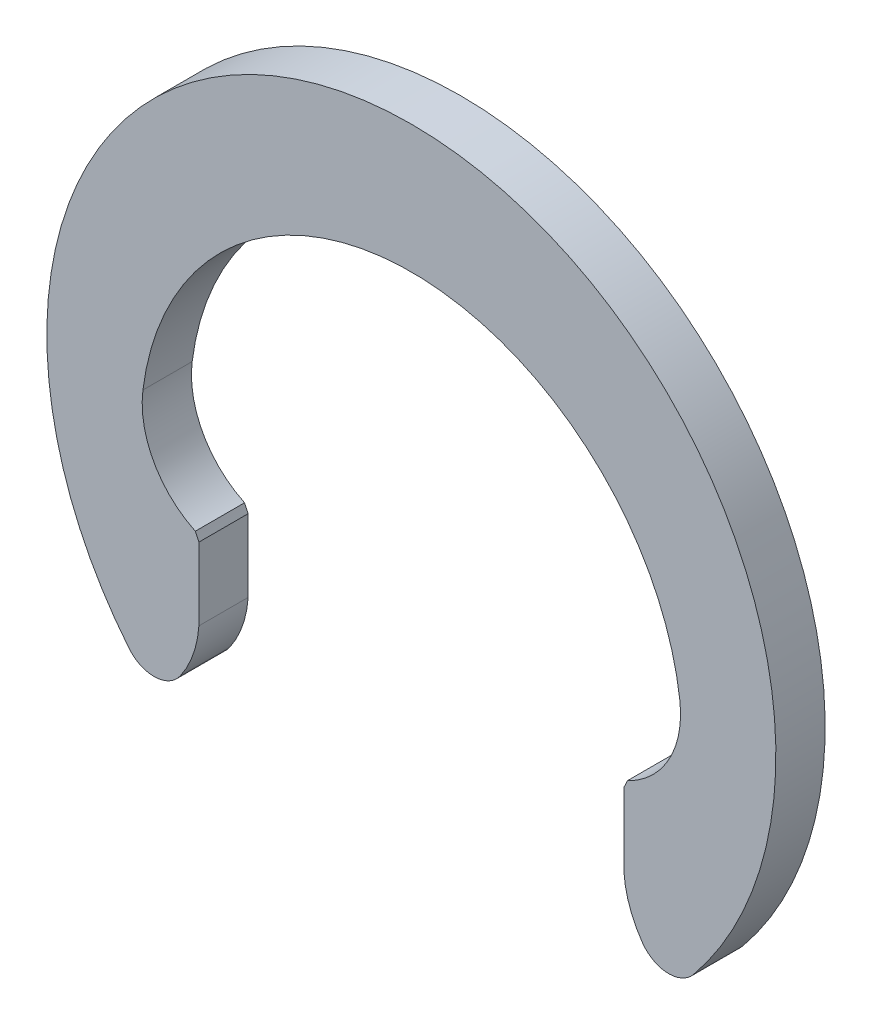
ISO-10303-21;
HEADER;
FILE_DESCRIPTION(('STEP AP214'),'2;1');
FILE_NAME('part.step','',(''),(''),'','','');
FILE_SCHEMA(('AUTOMOTIVE_DESIGN { 1 0 10303 214 1 1 1 1 }'));
ENDSEC;
DATA;
#1=APPLICATION_CONTEXT('core data for automotive mechanical design processes');
#2=APPLICATION_PROTOCOL_DEFINITION('international standard','automotive_design',2000,#1);
#3=PRODUCT_CONTEXT('',#1,'mechanical');
#4=PRODUCT('Part','Part','',(#3));
#5=PRODUCT_RELATED_PRODUCT_CATEGORY('part','',(#4));
#6=PRODUCT_DEFINITION_FORMATION('','',#4);
#7=PRODUCT_DEFINITION_CONTEXT('part definition',#1,'design');
#8=PRODUCT_DEFINITION('design','',#6,#7);
#9=PRODUCT_DEFINITION_SHAPE('','',#8);
#10=(LENGTH_UNIT() NAMED_UNIT(*) SI_UNIT(.MILLI.,.METRE.));
#11=(NAMED_UNIT(*) PLANE_ANGLE_UNIT() SI_UNIT($,.RADIAN.));
#12=(NAMED_UNIT(*) SI_UNIT($,.STERADIAN.) SOLID_ANGLE_UNIT());
#13=UNCERTAINTY_MEASURE_WITH_UNIT(LENGTH_MEASURE(1.E-05),#10,'distance_accuracy_value','');
#14=(GEOMETRIC_REPRESENTATION_CONTEXT(3) GLOBAL_UNCERTAINTY_ASSIGNED_CONTEXT((#13)) GLOBAL_UNIT_ASSIGNED_CONTEXT((#10,
#11,#12)) REPRESENTATION_CONTEXT('',''));
#15=CARTESIAN_POINT('',(0.,0.,0.));
#16=DIRECTION('',(0.,0.,1.));
#17=DIRECTION('',(1.,0.,0.));
#18=AXIS2_PLACEMENT_3D('',#15,#16,#17);
#19=CARTESIAN_POINT('',(0.,0.,-0.35));
#20=DIRECTION('',(0.,0.,1.));
#21=DIRECTION('',(1.,0.,0.));
#22=AXIS2_PLACEMENT_3D('',#19,#20,#21);
#23=PLANE('',#22);
#24=CARTESIAN_POINT('',(0.,0.,-0.35));
#25=DIRECTION('',(0.,0.,1.));
#26=DIRECTION('',(1.,0.,0.));
#27=AXIS2_PLACEMENT_3D('',#24,#25,#26);
#28=CIRCLE('',#27,3.7);
#29=CARTESIAN_POINT('',(2.86362795950369,-2.34299699307292,-0.35));
#30=VERTEX_POINT('',#29);
#31=CARTESIAN_POINT('',(-2.86362795950368,-2.34299699307293,-0.35));
#32=VERTEX_POINT('',#31);
#33=EDGE_CURVE('E194',#30,#32,#28,.T.);
#34=ORIENTED_EDGE('',*,*,#33,.F.);
#35=CARTESIAN_POINT('',(2.6120930711689,-2.13719320314084,-0.35));
#36=DIRECTION('',(0.,0.,-1.));
#37=DIRECTION('',(1.,0.,0.));
#38=AXIS2_PLACEMENT_3D('',#35,#36,#37);
#39=CIRCLE('',#38,0.325);
#40=CARTESIAN_POINT('',(2.34627823993633,-2.32418912688464,-0.35));
#41=VERTEX_POINT('',#40);
#42=EDGE_CURVE('E267',#30,#41,#39,.T.);
#43=ORIENTED_EDGE('',*,*,#42,.T.);
#44=CARTESIAN_POINT('',(3.20865351956933,-1.71752372269696,-0.35));
#45=DIRECTION('',(0.,0.,1.));
#46=DIRECTION('',(1.,0.,0.));
#47=AXIS2_PLACEMENT_3D('',#44,#45,#46);
#48=CIRCLE('',#47,1.05438799099777);
#49=CARTESIAN_POINT('',(2.15667568261897,-1.78877444989019,-0.35));
#50=VERTEX_POINT('',#49);
#51=EDGE_CURVE('E214',#50,#41,#48,.T.);
#52=ORIENTED_EDGE('',*,*,#51,.F.);
#53=DIRECTION('',(0.,-1.,0.));
#54=VECTOR('',#53,1.);
#55=CARTESIAN_POINT('',(2.15667568261898,-1.78877444989019,-0.35));
#56=LINE('',#55,#54);
#57=CARTESIAN_POINT('',(2.15667568261897,-1.05297198443263,-0.35));
#58=VERTEX_POINT('',#57);
#59=EDGE_CURVE('E11',#58,#50,#56,.T.);
#60=ORIENTED_EDGE('',*,*,#59,.F.);
#61=CARTESIAN_POINT('',(0.,0.,-0.35));
#62=DIRECTION('',(0.,0.,-1.));
#63=DIRECTION('',(-1.,0.,0.));
#64=AXIS2_PLACEMENT_3D('',#61,#62,#63);
#65=CIRCLE('',#64,2.4);
#66=CARTESIAN_POINT('',(2.19302872758202,-0.975,-0.35));
#67=VERTEX_POINT('',#66);
#68=EDGE_CURVE('E205',#67,#58,#65,.T.);
#69=ORIENTED_EDGE('',*,*,#68,.F.);
#70=CARTESIAN_POINT('',(1.78492705087858,-0.119710168645288,-0.35));
#71=DIRECTION('',(0.,0.,-1.));
#72=DIRECTION('',(-1.,0.,0.));
#73=AXIS2_PLACEMENT_3D('',#70,#71,#72);
#74=CIRCLE('',#73,0.947664325669659);
#75=CARTESIAN_POINT('',(2.725,0.,-0.35));
#76=VERTEX_POINT('',#75);
#77=EDGE_CURVE('E206',#76,#67,#74,.T.);
#78=ORIENTED_EDGE('',*,*,#77,.F.);
#79=CARTESIAN_POINT('',(0.,-0.347005208333333,-0.35));
#80=DIRECTION('',(0.,0.,-1.));
#81=DIRECTION('',(1.,0.,0.));
#82=AXIS2_PLACEMENT_3D('',#79,#80,#81);
#83=CIRCLE('',#82,2.74700520833333);
#84=CARTESIAN_POINT('',(-2.725,0.,-0.35));
#85=VERTEX_POINT('',#84);
#86=EDGE_CURVE('E222',#85,#76,#83,.T.);
#87=ORIENTED_EDGE('',*,*,#86,.F.);
#88=CARTESIAN_POINT('',(-1.78492705087858,-0.119710168645288,-0.35));
#89=DIRECTION('',(0.,0.,-1.));
#90=DIRECTION('',(1.,0.,0.));
#91=AXIS2_PLACEMENT_3D('',#88,#89,#90);
#92=CIRCLE('',#91,0.947664325669659);
#93=CARTESIAN_POINT('',(-2.19302872758202,-0.975,-0.35));
#94=VERTEX_POINT('',#93);
#95=EDGE_CURVE('E213',#94,#85,#92,.T.);
#96=ORIENTED_EDGE('',*,*,#95,.F.);
#97=CARTESIAN_POINT('',(0.,0.,-0.35));
#98=DIRECTION('',(0.,0.,-1.));
#99=DIRECTION('',(1.,0.,0.));
#100=AXIS2_PLACEMENT_3D('',#97,#98,#99);
#101=CIRCLE('',#100,2.4);
#102=CARTESIAN_POINT('',(-2.15667568261897,-1.05297198443263,-0.35));
#103=VERTEX_POINT('',#102);
#104=EDGE_CURVE('E157',#103,#94,#101,.T.);
#105=ORIENTED_EDGE('',*,*,#104,.F.);
#106=DIRECTION('',(0.,1.,0.));
#107=VECTOR('',#106,1.);
#108=CARTESIAN_POINT('',(-2.15667568261897,-1.42087321716141,-0.35));
#109=LINE('',#108,#107);
#110=CARTESIAN_POINT('',(-2.15667568261897,-1.78877444989019,-0.35));
#111=VERTEX_POINT('',#110);
#112=EDGE_CURVE('E154',#111,#103,#109,.T.);
#113=ORIENTED_EDGE('',*,*,#112,.F.);
#114=CARTESIAN_POINT('',(-3.20865351956933,-1.71752372269696,-0.35));
#115=DIRECTION('',(0.,0.,1.));
#116=DIRECTION('',(-1.,0.,0.));
#117=AXIS2_PLACEMENT_3D('',#114,#115,#116);
#118=CIRCLE('',#117,1.05438799099777);
#119=CARTESIAN_POINT('',(-2.34627823993633,-2.32418912688465,-0.35));
#120=VERTEX_POINT('',#119);
#121=EDGE_CURVE('E143',#120,#111,#118,.T.);
#122=ORIENTED_EDGE('',*,*,#121,.F.);
#123=CARTESIAN_POINT('',(-2.6120930711689,-2.13719320314084,-0.35));
#124=DIRECTION('',(0.,0.,-1.));
#125=DIRECTION('',(1.,0.,0.));
#126=AXIS2_PLACEMENT_3D('',#123,#124,#125);
#127=CIRCLE('',#126,0.325);
#128=EDGE_CURVE('E23',#120,#32,#127,.T.);
#129=ORIENTED_EDGE('',*,*,#128,.T.);
#130=EDGE_LOOP('',(#34,#43,#52,#60,#69,#78,#87,#96,#105,#113,#122,#129));
#131=FACE_BOUND('',#130,.T.);
#132=ADVANCED_FACE('F19',(#131),#23,.F.);
#133=CARTESIAN_POINT('',(2.15667568261898,-1.78877444989019,0.35));
#134=DIRECTION('',(1.,0.,0.));
#135=DIRECTION('',(0.,1.,0.));
#136=AXIS2_PLACEMENT_3D('',#133,#134,#135);
#137=PLANE('',#136);
#138=DIRECTION('',(0.,1.,0.));
#139=VECTOR('',#138,1.);
#140=CARTESIAN_POINT('',(2.15667568261897,-0.894387224945091,0.15));
#141=LINE('',#140,#139);
#142=CARTESIAN_POINT('',(2.15667568261897,-1.78877444989019,0.15));
#143=VERTEX_POINT('',#142);
#144=CARTESIAN_POINT('',(2.15667568261897,-1.05297198443263,0.15));
#145=VERTEX_POINT('',#144);
#146=EDGE_CURVE('E164',#143,#145,#141,.T.);
#147=ORIENTED_EDGE('',*,*,#146,.T.);
#148=DIRECTION('',(0.,0.,-1.));
#149=VECTOR('',#148,1.);
#150=CARTESIAN_POINT('',(2.15667568261897,-1.05297198443263,0.35));
#151=LINE('',#150,#149);
#152=EDGE_CURVE('E30',#145,#58,#151,.T.);
#153=ORIENTED_EDGE('',*,*,#152,.T.);
#154=ORIENTED_EDGE('',*,*,#59,.T.);
#155=DIRECTION('',(0.,0.,-1.));
#156=VECTOR('',#155,1.);
#157=CARTESIAN_POINT('',(2.15667568261897,-1.78877444989019,0.35));
#158=LINE('',#157,#156);
#159=EDGE_CURVE('E263',#143,#50,#158,.T.);
#160=ORIENTED_EDGE('',*,*,#159,.F.);
#161=EDGE_LOOP('',(#147,#153,#154,#160));
#162=FACE_BOUND('',#161,.T.);
#163=ADVANCED_FACE('F412',(#162),#137,.F.);
#164=CARTESIAN_POINT('',(0.,0.,0.35));
#165=DIRECTION('',(0.,0.,-1.));
#166=DIRECTION('',(-1.,0.,0.));
#167=AXIS2_PLACEMENT_3D('',#164,#165,#166);
#168=CYLINDRICAL_SURFACE('',#167,2.4);
#169=CARTESIAN_POINT('',(0.,0.,0.15));
#170=DIRECTION('',(0.,0.,1.));
#171=DIRECTION('',(-1.,0.,0.));
#172=AXIS2_PLACEMENT_3D('',#169,#170,#171);
#173=CIRCLE('',#172,2.4);
#174=CARTESIAN_POINT('',(2.19302872758202,-0.975,0.15));
#175=VERTEX_POINT('',#174);
#176=EDGE_CURVE('E171',#145,#175,#173,.T.);
#177=ORIENTED_EDGE('',*,*,#176,.T.);
#178=DIRECTION('',(0.,0.,-1.));
#179=VECTOR('',#178,1.);
#180=CARTESIAN_POINT('',(2.19302872758202,-0.975,0.35));
#181=LINE('',#180,#179);
#182=EDGE_CURVE('E201',#175,#67,#181,.T.);
#183=ORIENTED_EDGE('',*,*,#182,.T.);
#184=ORIENTED_EDGE('',*,*,#68,.T.);
#185=ORIENTED_EDGE('',*,*,#152,.F.);
#186=EDGE_LOOP('',(#177,#183,#184,#185));
#187=FACE_BOUND('',#186,.T.);
#188=ADVANCED_FACE('F21',(#187),#168,.F.);
#189=CARTESIAN_POINT('',(1.78492705087858,-0.119710168645288,0.35));
#190=DIRECTION('',(0.,0.,-1.));
#191=DIRECTION('',(0.87783762329979,-0.478958356351965,0.));
#192=AXIS2_PLACEMENT_3D('',#189,#190,#191);
#193=CYLINDRICAL_SURFACE('',#192,0.947664325669659);
#194=CARTESIAN_POINT('',(1.78492705087858,-0.119710168645288,0.15));
#195=DIRECTION('',(0.,0.,1.));
#196=DIRECTION('',(-1.,0.,0.));
#197=AXIS2_PLACEMENT_3D('',#194,#195,#196);
#198=CIRCLE('',#197,0.947664325669659);
#199=CARTESIAN_POINT('',(2.725,0.,0.15));
#200=VERTEX_POINT('',#199);
#201=EDGE_CURVE('E185',#175,#200,#198,.T.);
#202=ORIENTED_EDGE('',*,*,#201,.T.);
#203=DIRECTION('',(0.,0.,-1.));
#204=VECTOR('',#203,1.);
#205=CARTESIAN_POINT('',(2.725,0.,0.35));
#206=LINE('',#205,#204);
#207=EDGE_CURVE('E226',#200,#76,#206,.T.);
#208=ORIENTED_EDGE('',*,*,#207,.T.);
#209=ORIENTED_EDGE('',*,*,#77,.T.);
#210=ORIENTED_EDGE('',*,*,#182,.F.);
#211=EDGE_LOOP('',(#202,#208,#209,#210));
#212=FACE_BOUND('',#211,.T.);
#213=ADVANCED_FACE('F255',(#212),#193,.F.);
#214=CARTESIAN_POINT('',(0.,-0.347005208333333,0.35));
#215=DIRECTION('',(0.,0.,-1.));
#216=DIRECTION('',(-1.,0.,0.));
#217=AXIS2_PLACEMENT_3D('',#214,#215,#216);
#218=CYLINDRICAL_SURFACE('',#217,2.74700520833333);
#219=CARTESIAN_POINT('',(0.,-0.347005208333333,0.15));
#220=DIRECTION('',(0.,0.,1.));
#221=DIRECTION('',(-1.,0.,0.));
#222=AXIS2_PLACEMENT_3D('',#219,#220,#221);
#223=CIRCLE('',#222,2.74700520833333);
#224=CARTESIAN_POINT('',(-2.725,0.,0.15));
#225=VERTEX_POINT('',#224);
#226=EDGE_CURVE('E189',#200,#225,#223,.T.);
#227=ORIENTED_EDGE('',*,*,#226,.T.);
#228=DIRECTION('',(0.,0.,-1.));
#229=VECTOR('',#228,1.);
#230=CARTESIAN_POINT('',(-2.725,0.,0.35));
#231=LINE('',#230,#229);
#232=EDGE_CURVE('E221',#225,#85,#231,.T.);
#233=ORIENTED_EDGE('',*,*,#232,.T.);
#234=ORIENTED_EDGE('',*,*,#86,.T.);
#235=ORIENTED_EDGE('',*,*,#207,.F.);
#236=EDGE_LOOP('',(#227,#233,#234,#235));
#237=FACE_BOUND('',#236,.T.);
#238=ADVANCED_FACE('F439',(#237),#218,.F.);
#239=CARTESIAN_POINT('',(0.,0.,0.35));
#240=DIRECTION('',(0.,0.,-1.));
#241=DIRECTION('',(-1.,0.,0.));
#242=AXIS2_PLACEMENT_3D('',#239,#240,#241);
#243=CYLINDRICAL_SURFACE('',#242,2.4);
#244=CARTESIAN_POINT('',(0.,0.,0.15));
#245=DIRECTION('',(0.,0.,1.));
#246=DIRECTION('',(-1.,0.,0.));
#247=AXIS2_PLACEMENT_3D('',#244,#245,#246);
#248=CIRCLE('',#247,2.4);
#249=CARTESIAN_POINT('',(-2.19302872758202,-0.975,0.15));
#250=VERTEX_POINT('',#249);
#251=CARTESIAN_POINT('',(-2.15667568261897,-1.05297198443263,0.15));
#252=VERTEX_POINT('',#251);
#253=EDGE_CURVE('E207',#250,#252,#248,.T.);
#254=ORIENTED_EDGE('',*,*,#253,.T.);
#255=DIRECTION('',(0.,0.,-1.));
#256=VECTOR('',#255,1.);
#257=CARTESIAN_POINT('',(-2.15667568261897,-1.05297198443263,0.35));
#258=LINE('',#257,#256);
#259=EDGE_CURVE('E77',#252,#103,#258,.T.);
#260=ORIENTED_EDGE('',*,*,#259,.T.);
#261=ORIENTED_EDGE('',*,*,#104,.T.);
#262=DIRECTION('',(0.,0.,-1.));
#263=VECTOR('',#262,1.);
#264=CARTESIAN_POINT('',(-2.19302872758202,-0.975,0.35));
#265=LINE('',#264,#263);
#266=EDGE_CURVE('E60',#250,#94,#265,.T.);
#267=ORIENTED_EDGE('',*,*,#266,.F.);
#268=EDGE_LOOP('',(#254,#260,#261,#267));
#269=FACE_BOUND('',#268,.T.);
#270=ADVANCED_FACE('F435',(#269),#243,.F.);
#271=CARTESIAN_POINT('',(-1.78492705087858,-0.119710168645288,0.35));
#272=DIRECTION('',(0.,0.,-1.));
#273=DIRECTION('',(-1.,0.,0.));
#274=AXIS2_PLACEMENT_3D('',#271,#272,#273);
#275=CYLINDRICAL_SURFACE('',#274,0.947664325669659);
#276=CARTESIAN_POINT('',(-1.78492705087858,-0.119710168645288,0.15));
#277=DIRECTION('',(0.,0.,1.));
#278=DIRECTION('',(-1.,0.,0.));
#279=AXIS2_PLACEMENT_3D('',#276,#277,#278);
#280=CIRCLE('',#279,0.947664325669659);
#281=EDGE_CURVE('E210',#225,#250,#280,.T.);
#282=ORIENTED_EDGE('',*,*,#281,.T.);
#283=ORIENTED_EDGE('',*,*,#266,.T.);
#284=ORIENTED_EDGE('',*,*,#95,.T.);
#285=ORIENTED_EDGE('',*,*,#232,.F.);
#286=EDGE_LOOP('',(#282,#283,#284,#285));
#287=FACE_BOUND('',#286,.T.);
#288=ADVANCED_FACE('F432',(#287),#275,.F.);
#289=CARTESIAN_POINT('',(3.20865351956933,-1.71752372269696,0.35));
#290=DIRECTION('',(0.,0.,-1.));
#291=DIRECTION('',(-1.,0.,0.));
#292=AXIS2_PLACEMENT_3D('',#289,#290,#291);
#293=CYLINDRICAL_SURFACE('',#292,1.05438799099777);
#294=CARTESIAN_POINT('',(3.20865351956933,-1.71752372269696,0.15));
#295=DIRECTION('',(0.,0.,-1.));
#296=DIRECTION('',(-1.,0.,0.));
#297=AXIS2_PLACEMENT_3D('',#294,#295,#296);
#298=CIRCLE('',#297,1.05438799099777);
#299=CARTESIAN_POINT('',(2.34627823993633,-2.32418912688464,0.15));
#300=VERTEX_POINT('',#299);
#301=EDGE_CURVE('E175',#300,#143,#298,.T.);
#302=ORIENTED_EDGE('',*,*,#301,.T.);
#303=ORIENTED_EDGE('',*,*,#159,.T.);
#304=ORIENTED_EDGE('',*,*,#51,.T.);
#305=DIRECTION('',(0.,0.,1.));
#306=VECTOR('',#305,1.);
#307=CARTESIAN_POINT('',(2.34627823993633,-2.32418912688464,0.35));
#308=LINE('',#307,#306);
#309=EDGE_CURVE('E197',#41,#300,#308,.T.);
#310=ORIENTED_EDGE('',*,*,#309,.T.);
#311=EDGE_LOOP('',(#302,#303,#304,#310));
#312=FACE_BOUND('',#311,.T.);
#313=ADVANCED_FACE('F278',(#312),#293,.T.);
#314=CARTESIAN_POINT('',(2.6120930711689,-2.13719320314084,0.35));
#315=DIRECTION('',(0.,0.,-1.));
#316=DIRECTION('',(-1.,0.,0.));
#317=AXIS2_PLACEMENT_3D('',#314,#315,#316);
#318=CYLINDRICAL_SURFACE('',#317,0.325);
#319=CARTESIAN_POINT('',(2.6120930711689,-2.13719320314084,0.15));
#320=DIRECTION('',(0.,0.,-1.));
#321=DIRECTION('',(-1.,0.,0.));
#322=AXIS2_PLACEMENT_3D('',#319,#320,#321);
#323=CIRCLE('',#322,0.325);
#324=CARTESIAN_POINT('',(2.86362795950369,-2.34299699307292,0.15));
#325=VERTEX_POINT('',#324);
#326=EDGE_CURVE('E179',#325,#300,#323,.T.);
#327=ORIENTED_EDGE('',*,*,#326,.T.);
#328=ORIENTED_EDGE('',*,*,#309,.F.);
#329=ORIENTED_EDGE('',*,*,#42,.F.);
#330=DIRECTION('',(0.,0.,-1.));
#331=VECTOR('',#330,1.);
#332=CARTESIAN_POINT('',(2.86362795950369,-2.34299699307292,0.35));
#333=LINE('',#332,#331);
#334=EDGE_CURVE('E190',#325,#30,#333,.T.);
#335=ORIENTED_EDGE('',*,*,#334,.F.);
#336=EDGE_LOOP('',(#327,#328,#329,#335));
#337=FACE_BOUND('',#336,.T.);
#338=ADVANCED_FACE('F282',(#337),#318,.T.);
#339=CARTESIAN_POINT('',(0.,0.,0.35));
#340=DIRECTION('',(0.,0.,-1.));
#341=DIRECTION('',(0.,1.,0.));
#342=AXIS2_PLACEMENT_3D('',#339,#340,#341);
#343=CYLINDRICAL_SURFACE('',#342,3.7);
#344=CARTESIAN_POINT('',(0.,0.,0.15));
#345=DIRECTION('',(0.,0.,-1.));
#346=DIRECTION('',(-1.,0.,0.));
#347=AXIS2_PLACEMENT_3D('',#344,#345,#346);
#348=CIRCLE('',#347,3.7);
#349=CARTESIAN_POINT('',(-2.86362795950368,-2.34299699307293,0.15));
#350=VERTEX_POINT('',#349);
#351=EDGE_CURVE('E180',#350,#325,#348,.T.);
#352=ORIENTED_EDGE('',*,*,#351,.T.);
#353=ORIENTED_EDGE('',*,*,#334,.T.);
#354=ORIENTED_EDGE('',*,*,#33,.T.);
#355=DIRECTION('',(0.,0.,1.));
#356=VECTOR('',#355,1.);
#357=CARTESIAN_POINT('',(-2.86362795950368,-2.34299699307293,0.35));
#358=LINE('',#357,#356);
#359=EDGE_CURVE('E152',#32,#350,#358,.T.);
#360=ORIENTED_EDGE('',*,*,#359,.T.);
#361=EDGE_LOOP('',(#352,#353,#354,#360));
#362=FACE_BOUND('',#361,.T.);
#363=ADVANCED_FACE('F302',(#362),#343,.T.);
#364=CARTESIAN_POINT('',(-2.6120930711689,-2.13719320314084,0.35));
#365=DIRECTION('',(0.,0.,-1.));
#366=DIRECTION('',(-1.,0.,0.));
#367=AXIS2_PLACEMENT_3D('',#364,#365,#366);
#368=CYLINDRICAL_SURFACE('',#367,0.325);
#369=CARTESIAN_POINT('',(-2.6120930711689,-2.13719320314084,0.15));
#370=DIRECTION('',(0.,0.,-1.));
#371=DIRECTION('',(-1.,0.,0.));
#372=AXIS2_PLACEMENT_3D('',#369,#370,#371);
#373=CIRCLE('',#372,0.325);
#374=CARTESIAN_POINT('',(-2.34627823993633,-2.32418912688465,0.15));
#375=VERTEX_POINT('',#374);
#376=EDGE_CURVE('E184',#375,#350,#373,.T.);
#377=ORIENTED_EDGE('',*,*,#376,.T.);
#378=ORIENTED_EDGE('',*,*,#359,.F.);
#379=ORIENTED_EDGE('',*,*,#128,.F.);
#380=DIRECTION('',(0.,0.,-1.));
#381=VECTOR('',#380,1.);
#382=CARTESIAN_POINT('',(-2.34627823993633,-2.32418912688465,0.35));
#383=LINE('',#382,#381);
#384=EDGE_CURVE('E149',#375,#120,#383,.T.);
#385=ORIENTED_EDGE('',*,*,#384,.F.);
#386=EDGE_LOOP('',(#377,#378,#379,#385));
#387=FACE_BOUND('',#386,.T.);
#388=ADVANCED_FACE('F300',(#387),#368,.T.);
#389=CARTESIAN_POINT('',(-3.20865351956933,-1.71752372269696,0.35));
#390=DIRECTION('',(0.,0.,-1.));
#391=DIRECTION('',(-1.,0.,0.));
#392=AXIS2_PLACEMENT_3D('',#389,#390,#391);
#393=CYLINDRICAL_SURFACE('',#392,1.05438799099777);
#394=CARTESIAN_POINT('',(-3.20865351956933,-1.71752372269696,0.15));
#395=DIRECTION('',(0.,0.,-1.));
#396=DIRECTION('',(-1.,0.,0.));
#397=AXIS2_PLACEMENT_3D('',#394,#395,#396);
#398=CIRCLE('',#397,1.05438799099777);
#399=CARTESIAN_POINT('',(-2.15667568261897,-1.78877444989019,0.15));
#400=VERTEX_POINT('',#399);
#401=EDGE_CURVE('E198',#400,#375,#398,.T.);
#402=ORIENTED_EDGE('',*,*,#401,.T.);
#403=ORIENTED_EDGE('',*,*,#384,.T.);
#404=ORIENTED_EDGE('',*,*,#121,.T.);
#405=DIRECTION('',(0.,0.,-1.));
#406=VECTOR('',#405,1.);
#407=CARTESIAN_POINT('',(-2.15667568261897,-1.78877444989019,0.35));
#408=LINE('',#407,#406);
#409=EDGE_CURVE('E148',#400,#111,#408,.T.);
#410=ORIENTED_EDGE('',*,*,#409,.F.);
#411=EDGE_LOOP('',(#402,#403,#404,#410));
#412=FACE_BOUND('',#411,.T.);
#413=ADVANCED_FACE('F146',(#412),#393,.T.);
#414=CARTESIAN_POINT('',(-2.15667568261897,-1.42087321716141,0.35));
#415=DIRECTION('',(-1.,0.,0.));
#416=DIRECTION('',(0.,0.,1.));
#417=AXIS2_PLACEMENT_3D('',#414,#415,#416);
#418=PLANE('',#417);
#419=DIRECTION('',(0.,-1.,0.));
#420=VECTOR('',#419,1.);
#421=CARTESIAN_POINT('',(-2.15667568261897,-0.710436608580704,0.15));
#422=LINE('',#421,#420);
#423=EDGE_CURVE('E161',#252,#400,#422,.T.);
#424=ORIENTED_EDGE('',*,*,#423,.T.);
#425=ORIENTED_EDGE('',*,*,#409,.T.);
#426=ORIENTED_EDGE('',*,*,#112,.T.);
#427=ORIENTED_EDGE('',*,*,#259,.F.);
#428=EDGE_LOOP('',(#424,#425,#426,#427));
#429=FACE_BOUND('',#428,.T.);
#430=ADVANCED_FACE('F159',(#429),#418,.F.);
#431=CARTESIAN_POINT('',(0.,0.,0.15));
#432=DIRECTION('',(0.,0.,1.));
#433=DIRECTION('',(1.,0.,0.));
#434=AXIS2_PLACEMENT_3D('',#431,#432,#433);
#435=PLANE('',#434);
#436=ORIENTED_EDGE('',*,*,#301,.F.);
#437=ORIENTED_EDGE('',*,*,#326,.F.);
#438=ORIENTED_EDGE('',*,*,#351,.F.);
#439=ORIENTED_EDGE('',*,*,#376,.F.);
#440=ORIENTED_EDGE('',*,*,#401,.F.);
#441=ORIENTED_EDGE('',*,*,#423,.F.);
#442=ORIENTED_EDGE('',*,*,#253,.F.);
#443=ORIENTED_EDGE('',*,*,#281,.F.);
#444=ORIENTED_EDGE('',*,*,#226,.F.);
#445=ORIENTED_EDGE('',*,*,#201,.F.);
#446=ORIENTED_EDGE('',*,*,#176,.F.);
#447=ORIENTED_EDGE('',*,*,#146,.F.);
#448=EDGE_LOOP('',(#436,#437,#438,#439,#440,#441,#442,#443,#444,#445,#446,#447));
#449=FACE_BOUND('',#448,.T.);
#450=ADVANCED_FACE('F251',(#449),#435,.T.);
#451=CLOSED_SHELL('',(#132,#163,#188,#213,#238,#270,#288,#313,#338,#363,#388,#413,#430,#450));
#452=MANIFOLD_SOLID_BREP('B1',#451);
#453=ADVANCED_BREP_SHAPE_REPRESENTATION('',(#18,#452),#14);
#454=SHAPE_DEFINITION_REPRESENTATION(#9,#453);
ENDSEC;
END-ISO-10303-21;
